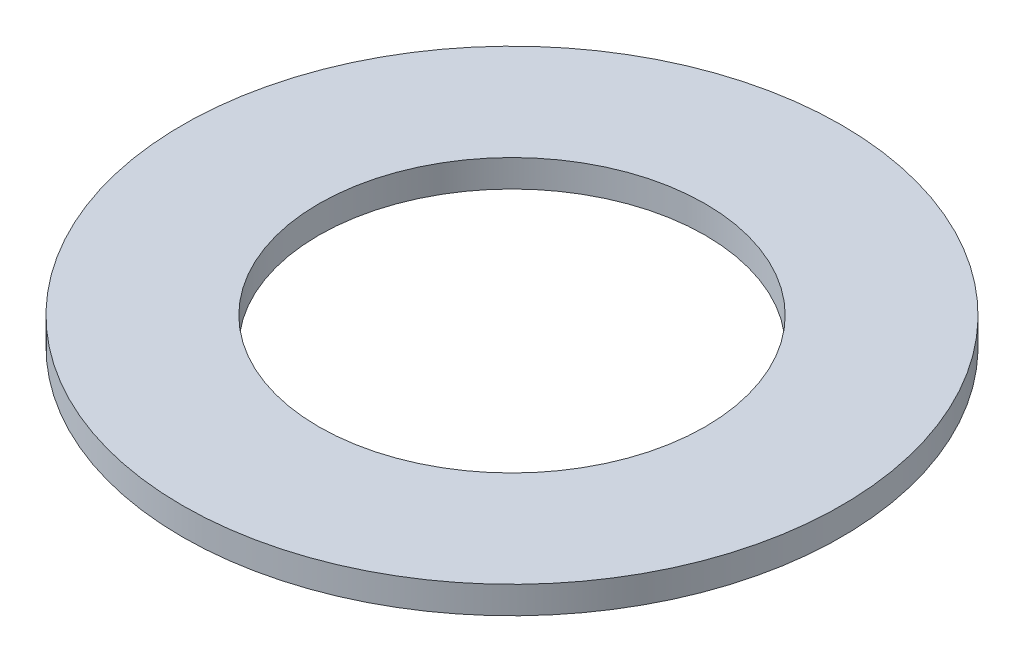
ISO-10303-21;
HEADER;
FILE_DESCRIPTION(('STEP AP214'),'2;1');
FILE_NAME('part.step','',(''),(''),'','','');
FILE_SCHEMA(('AUTOMOTIVE_DESIGN { 1 0 10303 214 1 1 1 1 }'));
ENDSEC;
DATA;
#1=APPLICATION_CONTEXT('core data for automotive mechanical design processes');
#2=APPLICATION_PROTOCOL_DEFINITION('international standard','automotive_design',2000,#1);
#3=PRODUCT_CONTEXT('',#1,'mechanical');
#4=PRODUCT('Part','Part','',(#3));
#5=PRODUCT_RELATED_PRODUCT_CATEGORY('part','',(#4));
#6=PRODUCT_DEFINITION_FORMATION('','',#4);
#7=PRODUCT_DEFINITION_CONTEXT('part definition',#1,'design');
#8=PRODUCT_DEFINITION('design','',#6,#7);
#9=PRODUCT_DEFINITION_SHAPE('','',#8);
#10=(LENGTH_UNIT() NAMED_UNIT(*) SI_UNIT(.MILLI.,.METRE.));
#11=(NAMED_UNIT(*) PLANE_ANGLE_UNIT() SI_UNIT($,.RADIAN.));
#12=(NAMED_UNIT(*) SI_UNIT($,.STERADIAN.) SOLID_ANGLE_UNIT());
#13=UNCERTAINTY_MEASURE_WITH_UNIT(LENGTH_MEASURE(1.E-05),#10,'distance_accuracy_value','');
#14=(GEOMETRIC_REPRESENTATION_CONTEXT(3) GLOBAL_UNCERTAINTY_ASSIGNED_CONTEXT((#13)) GLOBAL_UNIT_ASSIGNED_CONTEXT((#10,
#11,#12)) REPRESENTATION_CONTEXT('',''));
#15=CARTESIAN_POINT('',(0.,0.,0.));
#16=DIRECTION('',(0.,0.,1.));
#17=DIRECTION('',(1.,0.,0.));
#18=AXIS2_PLACEMENT_3D('',#15,#16,#17);
#19=CARTESIAN_POINT('',(0.,6.,0.));
#20=DIRECTION('',(0.,-1.,0.));
#21=DIRECTION('',(0.,0.,-1.));
#22=AXIS2_PLACEMENT_3D('',#19,#20,#21);
#23=CYLINDRICAL_SURFACE('',#22,72.5);
#24=CARTESIAN_POINT('',(0.,6.,0.));
#25=DIRECTION('',(0.,1.,0.));
#26=DIRECTION('',(0.,0.,1.));
#27=AXIS2_PLACEMENT_3D('',#24,#25,#26);
#28=CIRCLE('',#27,72.5);
#29=CARTESIAN_POINT('',(0.,6.,72.5));
#30=VERTEX_POINT('',#29);
#31=EDGE_CURVE('E10',#30,#30,#28,.T.);
#32=ORIENTED_EDGE('',*,*,#31,.F.);
#33=EDGE_LOOP('',(#32));
#34=FACE_BOUND('',#33,.T.);
#35=CARTESIAN_POINT('',(0.,0.,0.));
#36=DIRECTION('',(0.,1.,0.));
#37=DIRECTION('',(0.,0.,1.));
#38=AXIS2_PLACEMENT_3D('',#35,#36,#37);
#39=CIRCLE('',#38,72.5);
#40=CARTESIAN_POINT('',(0.,0.,72.5));
#41=VERTEX_POINT('',#40);
#42=EDGE_CURVE('E37',#41,#41,#39,.T.);
#43=ORIENTED_EDGE('',*,*,#42,.T.);
#44=EDGE_LOOP('',(#43));
#45=FACE_BOUND('',#44,.T.);
#46=ADVANCED_FACE('F40',(#34,#45),#23,.T.);
#47=CARTESIAN_POINT('',(0.,6.,0.));
#48=DIRECTION('',(0.,1.,0.));
#49=DIRECTION('',(0.,0.,1.));
#50=AXIS2_PLACEMENT_3D('',#47,#48,#49);
#51=PLANE('',#50);
#52=CARTESIAN_POINT('',(0.,6.,0.));
#53=DIRECTION('',(0.,1.,0.));
#54=DIRECTION('',(0.,0.,1.));
#55=AXIS2_PLACEMENT_3D('',#52,#53,#54);
#56=CIRCLE('',#55,42.5);
#57=CARTESIAN_POINT('',(0.,6.,42.5));
#58=VERTEX_POINT('',#57);
#59=EDGE_CURVE('E50',#58,#58,#56,.T.);
#60=ORIENTED_EDGE('',*,*,#59,.F.);
#61=EDGE_LOOP('',(#60));
#62=FACE_BOUND('',#61,.T.);
#63=ORIENTED_EDGE('',*,*,#31,.T.);
#64=EDGE_LOOP('',(#63));
#65=FACE_BOUND('',#64,.T.);
#66=ADVANCED_FACE('F59',(#62,#65),#51,.T.);
#67=CARTESIAN_POINT('',(0.,0.,0.));
#68=DIRECTION('',(0.,1.,0.));
#69=DIRECTION('',(0.,0.,1.));
#70=AXIS2_PLACEMENT_3D('',#67,#68,#69);
#71=PLANE('',#70);
#72=CARTESIAN_POINT('',(0.,0.,0.));
#73=DIRECTION('',(0.,1.,0.));
#74=DIRECTION('',(0.,0.,1.));
#75=AXIS2_PLACEMENT_3D('',#72,#73,#74);
#76=CIRCLE('',#75,42.5);
#77=CARTESIAN_POINT('',(0.,0.,42.5));
#78=VERTEX_POINT('',#77);
#79=EDGE_CURVE('E47',#78,#78,#76,.T.);
#80=ORIENTED_EDGE('',*,*,#79,.T.);
#81=EDGE_LOOP('',(#80));
#82=FACE_BOUND('',#81,.T.);
#83=ORIENTED_EDGE('',*,*,#42,.F.);
#84=EDGE_LOOP('',(#83));
#85=FACE_BOUND('',#84,.T.);
#86=ADVANCED_FACE('F58',(#82,#85),#71,.F.);
#87=CARTESIAN_POINT('',(0.,6.,0.));
#88=DIRECTION('',(0.,-1.,0.));
#89=DIRECTION('',(0.,0.,-1.));
#90=AXIS2_PLACEMENT_3D('',#87,#88,#89);
#91=CYLINDRICAL_SURFACE('',#90,42.5);
#92=ORIENTED_EDGE('',*,*,#59,.T.);
#93=EDGE_LOOP('',(#92));
#94=FACE_BOUND('',#93,.T.);
#95=ORIENTED_EDGE('',*,*,#79,.F.);
#96=EDGE_LOOP('',(#95));
#97=FACE_BOUND('',#96,.T.);
#98=ADVANCED_FACE('F54',(#94,#97),#91,.F.);
#99=CLOSED_SHELL('',(#46,#66,#86,#98));
#100=MANIFOLD_SOLID_BREP('B2',#99);
#101=ADVANCED_BREP_SHAPE_REPRESENTATION('',(#18,#100),#14);
#102=SHAPE_DEFINITION_REPRESENTATION(#9,#101);
ENDSEC;
END-ISO-10303-21;
